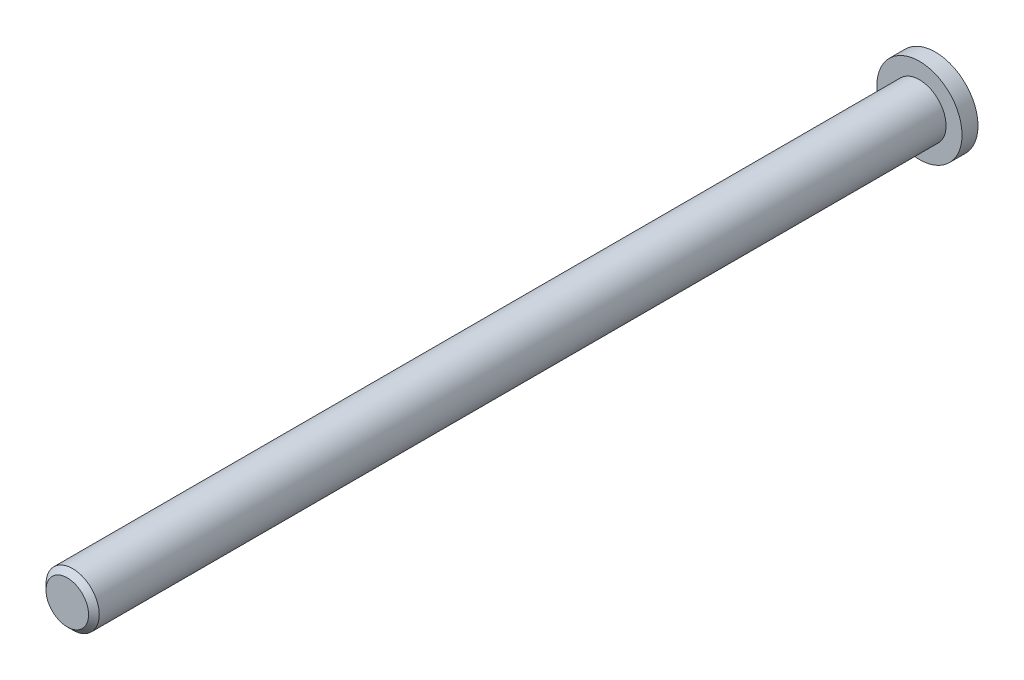
ISO-10303-21;
HEADER;
FILE_DESCRIPTION(('STEP AP214'),'2;1');
FILE_NAME('part.step','',(''),(''),'','','');
FILE_SCHEMA(('AUTOMOTIVE_DESIGN { 1 0 10303 214 1 1 1 1 }'));
ENDSEC;
DATA;
#1=APPLICATION_CONTEXT('core data for automotive mechanical design processes');
#2=APPLICATION_PROTOCOL_DEFINITION('international standard','automotive_design',2000,#1);
#3=PRODUCT_CONTEXT('',#1,'mechanical');
#4=PRODUCT('Part','Part','',(#3));
#5=PRODUCT_RELATED_PRODUCT_CATEGORY('part','',(#4));
#6=PRODUCT_DEFINITION_FORMATION('','',#4);
#7=PRODUCT_DEFINITION_CONTEXT('part definition',#1,'design');
#8=PRODUCT_DEFINITION('design','',#6,#7);
#9=PRODUCT_DEFINITION_SHAPE('','',#8);
#10=(LENGTH_UNIT() NAMED_UNIT(*) SI_UNIT(.MILLI.,.METRE.));
#11=(NAMED_UNIT(*) PLANE_ANGLE_UNIT() SI_UNIT($,.RADIAN.));
#12=(NAMED_UNIT(*) SI_UNIT($,.STERADIAN.) SOLID_ANGLE_UNIT());
#13=UNCERTAINTY_MEASURE_WITH_UNIT(LENGTH_MEASURE(1.E-05),#10,'distance_accuracy_value','');
#14=(GEOMETRIC_REPRESENTATION_CONTEXT(3) GLOBAL_UNCERTAINTY_ASSIGNED_CONTEXT((#13)) GLOBAL_UNIT_ASSIGNED_CONTEXT((#10,
#11,#12)) REPRESENTATION_CONTEXT('',''));
#15=CARTESIAN_POINT('',(0.,0.,0.));
#16=DIRECTION('',(0.,0.,1.));
#17=DIRECTION('',(1.,0.,0.));
#18=AXIS2_PLACEMENT_3D('',#15,#16,#17);
#19=CARTESIAN_POINT('',(0.,0.,1.5));
#20=DIRECTION('',(0.,0.,-1.));
#21=DIRECTION('',(-1.,0.,0.));
#22=AXIS2_PLACEMENT_3D('',#19,#20,#21);
#23=CYLINDRICAL_SURFACE('',#22,4.);
#24=CARTESIAN_POINT('',(0.,0.,1.5));
#25=DIRECTION('',(0.,0.,1.));
#26=DIRECTION('',(1.,0.,0.));
#27=AXIS2_PLACEMENT_3D('',#24,#25,#26);
#28=CIRCLE('',#27,4.);
#29=CARTESIAN_POINT('',(4.,0.,1.5));
#30=VERTEX_POINT('',#29);
#31=EDGE_CURVE('E57',#30,#30,#28,.T.);
#32=ORIENTED_EDGE('',*,*,#31,.F.);
#33=EDGE_LOOP('',(#32));
#34=FACE_BOUND('',#33,.T.);
#35=CARTESIAN_POINT('',(0.,0.,0.));
#36=DIRECTION('',(0.,0.,1.));
#37=DIRECTION('',(1.,0.,0.));
#38=AXIS2_PLACEMENT_3D('',#35,#36,#37);
#39=CIRCLE('',#38,4.);
#40=CARTESIAN_POINT('',(4.,0.,0.));
#41=VERTEX_POINT('',#40);
#42=EDGE_CURVE('E60',#41,#41,#39,.T.);
#43=ORIENTED_EDGE('',*,*,#42,.T.);
#44=EDGE_LOOP('',(#43));
#45=FACE_BOUND('',#44,.T.);
#46=ADVANCED_FACE('F39',(#34,#45),#23,.T.);
#47=CARTESIAN_POINT('',(0.,0.,1.5));
#48=DIRECTION('',(0.,0.,1.));
#49=DIRECTION('',(1.,0.,0.));
#50=AXIS2_PLACEMENT_3D('',#47,#48,#49);
#51=PLANE('',#50);
#52=CARTESIAN_POINT('',(0.,0.,1.5));
#53=DIRECTION('',(0.,0.,1.));
#54=DIRECTION('',(1.,0.,0.));
#55=AXIS2_PLACEMENT_3D('',#52,#53,#54);
#56=CIRCLE('',#55,2.5);
#57=CARTESIAN_POINT('',(2.5,0.,1.5));
#58=VERTEX_POINT('',#57);
#59=EDGE_CURVE('E52',#58,#58,#56,.T.);
#60=ORIENTED_EDGE('',*,*,#59,.F.);
#61=EDGE_LOOP('',(#60));
#62=FACE_BOUND('',#61,.T.);
#63=ORIENTED_EDGE('',*,*,#31,.T.);
#64=EDGE_LOOP('',(#63));
#65=FACE_BOUND('',#64,.T.);
#66=ADVANCED_FACE('F68',(#62,#65),#51,.T.);
#67=CARTESIAN_POINT('',(0.,0.,0.));
#68=DIRECTION('',(0.,0.,1.));
#69=DIRECTION('',(1.,0.,0.));
#70=AXIS2_PLACEMENT_3D('',#67,#68,#69);
#71=PLANE('',#70);
#72=ORIENTED_EDGE('',*,*,#42,.F.);
#73=EDGE_LOOP('',(#72));
#74=FACE_BOUND('',#73,.T.);
#75=ADVANCED_FACE('F74',(#74),#71,.F.);
#76=CARTESIAN_POINT('',(0.,0.,81.5));
#77=DIRECTION('',(0.,0.,-1.));
#78=DIRECTION('',(-1.,0.,0.));
#79=AXIS2_PLACEMENT_3D('',#76,#77,#78);
#80=CYLINDRICAL_SURFACE('',#79,2.5);
#81=CARTESIAN_POINT('',(0.,0.,81.));
#82=DIRECTION('',(0.,0.,1.));
#83=DIRECTION('',(1.,0.,0.));
#84=AXIS2_PLACEMENT_3D('',#81,#82,#83);
#85=CIRCLE('',#84,2.5);
#86=CARTESIAN_POINT('',(2.5,0.,81.));
#87=VERTEX_POINT('',#86);
#88=EDGE_CURVE('E10',#87,#87,#85,.F.);
#89=ORIENTED_EDGE('',*,*,#88,.T.);
#90=EDGE_LOOP('',(#89));
#91=FACE_BOUND('',#90,.T.);
#92=ORIENTED_EDGE('',*,*,#59,.T.);
#93=EDGE_LOOP('',(#92));
#94=FACE_BOUND('',#93,.T.);
#95=ADVANCED_FACE('F76',(#91,#94),#80,.T.);
#96=CARTESIAN_POINT('',(0.,0.,81.5));
#97=DIRECTION('',(0.,0.,1.));
#98=DIRECTION('',(1.,0.,0.));
#99=AXIS2_PLACEMENT_3D('',#96,#97,#98);
#100=PLANE('',#99);
#101=CARTESIAN_POINT('',(0.,0.,81.5));
#102=DIRECTION('',(0.,0.,1.));
#103=DIRECTION('',(1.,0.,0.));
#104=AXIS2_PLACEMENT_3D('',#101,#102,#103);
#105=CIRCLE('',#104,1.99999999999999);
#106=CARTESIAN_POINT('',(1.99999999999999,0.,81.5));
#107=VERTEX_POINT('',#106);
#108=EDGE_CURVE('E47',#107,#107,#105,.T.);
#109=ORIENTED_EDGE('',*,*,#108,.T.);
#110=EDGE_LOOP('',(#109));
#111=FACE_BOUND('',#110,.T.);
#112=ADVANCED_FACE('F82',(#111),#100,.T.);
#113=CARTESIAN_POINT('',(0.,0.,81.5));
#114=DIRECTION('',(0.,0.,-1.));
#115=DIRECTION('',(-1.,0.,0.));
#116=AXIS2_PLACEMENT_3D('',#113,#114,#115);
#117=CONICAL_SURFACE('',#116,1.99999999999999,0.785398163397467);
#118=ORIENTED_EDGE('',*,*,#88,.F.);
#119=EDGE_LOOP('',(#118));
#120=FACE_BOUND('',#119,.T.);
#121=ORIENTED_EDGE('',*,*,#108,.F.);
#122=EDGE_LOOP('',(#121));
#123=FACE_BOUND('',#122,.T.);
#124=ADVANCED_FACE('F41',(#120,#123),#117,.T.);
#125=CLOSED_SHELL('',(#46,#66,#75,#95,#112,#124));
#126=MANIFOLD_SOLID_BREP('B2',#125);
#127=ADVANCED_BREP_SHAPE_REPRESENTATION('',(#18,#126),#14);
#128=SHAPE_DEFINITION_REPRESENTATION(#9,#127);
ENDSEC;
END-ISO-10303-21;
